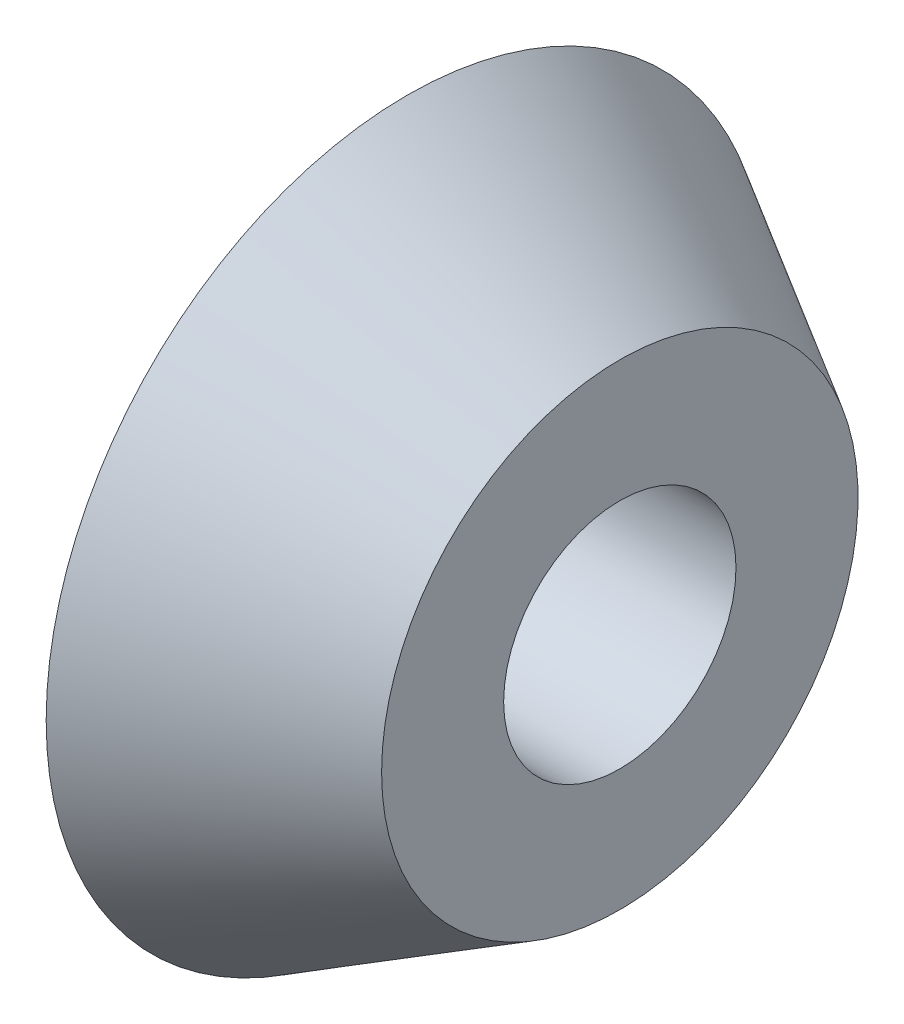
ISO-10303-21;
HEADER;
FILE_DESCRIPTION(('STEP AP214'),'2;1');
FILE_NAME('part.step','',(''),(''),'','','');
FILE_SCHEMA(('AUTOMOTIVE_DESIGN { 1 0 10303 214 1 1 1 1 }'));
ENDSEC;
DATA;
#1=APPLICATION_CONTEXT('core data for automotive mechanical design processes');
#2=APPLICATION_PROTOCOL_DEFINITION('international standard','automotive_design',2000,#1);
#3=PRODUCT_CONTEXT('',#1,'mechanical');
#4=PRODUCT('Part','Part','',(#3));
#5=PRODUCT_RELATED_PRODUCT_CATEGORY('part','',(#4));
#6=PRODUCT_DEFINITION_FORMATION('','',#4);
#7=PRODUCT_DEFINITION_CONTEXT('part definition',#1,'design');
#8=PRODUCT_DEFINITION('design','',#6,#7);
#9=PRODUCT_DEFINITION_SHAPE('','',#8);
#10=(LENGTH_UNIT() NAMED_UNIT(*) SI_UNIT(.MILLI.,.METRE.));
#11=(NAMED_UNIT(*) PLANE_ANGLE_UNIT() SI_UNIT($,.RADIAN.));
#12=(NAMED_UNIT(*) SI_UNIT($,.STERADIAN.) SOLID_ANGLE_UNIT());
#13=UNCERTAINTY_MEASURE_WITH_UNIT(LENGTH_MEASURE(1.E-05),#10,'distance_accuracy_value','');
#14=(GEOMETRIC_REPRESENTATION_CONTEXT(3) GLOBAL_UNCERTAINTY_ASSIGNED_CONTEXT((#13)) GLOBAL_UNIT_ASSIGNED_CONTEXT((#10,
#11,#12)) REPRESENTATION_CONTEXT('',''));
#15=CARTESIAN_POINT('',(0.,0.,0.));
#16=DIRECTION('',(0.,0.,1.));
#17=DIRECTION('',(1.,0.,0.));
#18=AXIS2_PLACEMENT_3D('',#15,#16,#17);
#19=CARTESIAN_POINT('',(4.41320981879205,15.494,0.));
#20=DIRECTION('',(1.,0.,0.));
#21=DIRECTION('',(0.,0.,-1.));
#22=AXIS2_PLACEMENT_3D('',#19,#20,#21);
#23=PLANE('',#22);
#24=CARTESIAN_POINT('',(4.41320981879205,0.,0.));
#25=DIRECTION('',(-1.,0.,0.));
#26=DIRECTION('',(0.,0.,1.));
#27=AXIS2_PLACEMENT_3D('',#24,#25,#26);
#28=CIRCLE('',#27,8.0518);
#29=CARTESIAN_POINT('',(4.41320981879205,0.,8.0518));
#30=VERTEX_POINT('',#29);
#31=EDGE_CURVE('E10',#30,#30,#28,.T.);
#32=ORIENTED_EDGE('',*,*,#31,.F.);
#33=EDGE_LOOP('',(#32));
#34=FACE_BOUND('',#33,.T.);
#35=CARTESIAN_POINT('',(4.41320981879205,0.,0.));
#36=DIRECTION('',(-1.,0.,0.));
#37=DIRECTION('',(0.,0.,1.));
#38=AXIS2_PLACEMENT_3D('',#35,#36,#37);
#39=CIRCLE('',#38,15.494);
#40=CARTESIAN_POINT('',(4.41320981879205,0.,15.494));
#41=VERTEX_POINT('',#40);
#42=EDGE_CURVE('E58',#41,#41,#39,.T.);
#43=ORIENTED_EDGE('',*,*,#42,.T.);
#44=EDGE_LOOP('',(#43));
#45=FACE_BOUND('',#44,.T.);
#46=ADVANCED_FACE('F33',(#34,#45),#23,.F.);
#47=CARTESIAN_POINT('',(0.,0.,0.));
#48=DIRECTION('',(-1.,0.,0.));
#49=DIRECTION('',(0.,0.,1.));
#50=AXIS2_PLACEMENT_3D('',#47,#48,#49);
#51=CYLINDRICAL_SURFACE('',#50,8.0518);
#52=CARTESIAN_POINT('',(25.5012301403958,0.,0.));
#53=DIRECTION('',(-1.,0.,0.));
#54=DIRECTION('',(0.,0.,1.));
#55=AXIS2_PLACEMENT_3D('',#52,#53,#54);
#56=CIRCLE('',#55,8.0518);
#57=CARTESIAN_POINT('',(25.5012301403958,0.,8.0518));
#58=VERTEX_POINT('',#57);
#59=EDGE_CURVE('E39',#58,#58,#56,.T.);
#60=ORIENTED_EDGE('',*,*,#59,.F.);
#61=EDGE_LOOP('',(#60));
#62=FACE_BOUND('',#61,.T.);
#63=ORIENTED_EDGE('',*,*,#31,.T.);
#64=EDGE_LOOP('',(#63));
#65=FACE_BOUND('',#64,.T.);
#66=ADVANCED_FACE('F89',(#62,#65),#51,.F.);
#67=CARTESIAN_POINT('',(25.5012301403958,8.0518,0.));
#68=DIRECTION('',(-1.,0.,0.));
#69=DIRECTION('',(0.,0.,1.));
#70=AXIS2_PLACEMENT_3D('',#67,#68,#69);
#71=PLANE('',#70);
#72=CARTESIAN_POINT('',(25.5012301403958,0.,0.));
#73=DIRECTION('',(-1.,0.,0.));
#74=DIRECTION('',(0.,0.,1.));
#75=AXIS2_PLACEMENT_3D('',#72,#73,#74);
#76=CIRCLE('',#75,16.51);
#77=CARTESIAN_POINT('',(25.5012301403958,0.,16.51));
#78=VERTEX_POINT('',#77);
#79=EDGE_CURVE('E43',#78,#78,#76,.T.);
#80=ORIENTED_EDGE('',*,*,#79,.F.);
#81=EDGE_LOOP('',(#80));
#82=FACE_BOUND('',#81,.T.);
#83=ORIENTED_EDGE('',*,*,#59,.T.);
#84=EDGE_LOOP('',(#83));
#85=FACE_BOUND('',#84,.T.);
#86=ADVANCED_FACE('F84',(#82,#85),#71,.F.);
#87=CARTESIAN_POINT('',(25.5012301403958,0.,0.));
#88=DIRECTION('',(-1.,0.,0.));
#89=DIRECTION('',(0.,0.,1.));
#90=AXIS2_PLACEMENT_3D('',#87,#88,#89);
#91=CONICAL_SURFACE('',#90,16.51,0.523598775598293);
#92=CARTESIAN_POINT('',(10.763209818792,0.,0.));
#93=DIRECTION('',(-1.,0.,0.));
#94=DIRECTION('',(0.,0.,1.));
#95=AXIS2_PLACEMENT_3D('',#92,#93,#94);
#96=CIRCLE('',#95,25.019);
#97=CARTESIAN_POINT('',(10.763209818792,0.,25.019));
#98=VERTEX_POINT('',#97);
#99=EDGE_CURVE('E47',#98,#98,#96,.T.);
#100=ORIENTED_EDGE('',*,*,#99,.F.);
#101=EDGE_LOOP('',(#100));
#102=FACE_BOUND('',#101,.T.);
#103=ORIENTED_EDGE('',*,*,#79,.T.);
#104=EDGE_LOOP('',(#103));
#105=FACE_BOUND('',#104,.T.);
#106=ADVANCED_FACE('F78',(#102,#105),#91,.T.);
#107=CARTESIAN_POINT('',(10.763209818792,25.019,0.));
#108=DIRECTION('',(1.,0.,0.));
#109=DIRECTION('',(0.,0.,-1.));
#110=AXIS2_PLACEMENT_3D('',#107,#108,#109);
#111=PLANE('',#110);
#112=CARTESIAN_POINT('',(10.763209818792,0.,0.));
#113=DIRECTION('',(-1.,0.,0.));
#114=DIRECTION('',(0.,0.,1.));
#115=AXIS2_PLACEMENT_3D('',#112,#113,#114);
#116=CIRCLE('',#115,16.51);
#117=CARTESIAN_POINT('',(10.763209818792,0.,16.51));
#118=VERTEX_POINT('',#117);
#119=EDGE_CURVE('E52',#118,#118,#116,.T.);
#120=ORIENTED_EDGE('',*,*,#119,.F.);
#121=EDGE_LOOP('',(#120));
#122=FACE_BOUND('',#121,.T.);
#123=ORIENTED_EDGE('',*,*,#99,.T.);
#124=EDGE_LOOP('',(#123));
#125=FACE_BOUND('',#124,.T.);
#126=ADVANCED_FACE('F72',(#122,#125),#111,.F.);
#127=CARTESIAN_POINT('',(10.763209818792,0.,0.));
#128=DIRECTION('',(1.,0.,0.));
#129=DIRECTION('',(0.,0.,-1.));
#130=AXIS2_PLACEMENT_3D('',#127,#128,#129);
#131=CONICAL_SURFACE('',#130,16.51,0.785398163397448);
#132=CARTESIAN_POINT('',(9.74720981879205,0.,0.));
#133=DIRECTION('',(-1.,0.,0.));
#134=DIRECTION('',(0.,0.,1.));
#135=AXIS2_PLACEMENT_3D('',#132,#133,#134);
#136=CIRCLE('',#135,15.494);
#137=CARTESIAN_POINT('',(9.74720981879205,0.,15.494));
#138=VERTEX_POINT('',#137);
#139=EDGE_CURVE('E55',#138,#138,#136,.T.);
#140=ORIENTED_EDGE('',*,*,#139,.F.);
#141=EDGE_LOOP('',(#140));
#142=FACE_BOUND('',#141,.T.);
#143=ORIENTED_EDGE('',*,*,#119,.T.);
#144=EDGE_LOOP('',(#143));
#145=FACE_BOUND('',#144,.T.);
#146=ADVANCED_FACE('F66',(#142,#145),#131,.T.);
#147=CARTESIAN_POINT('',(0.,0.,0.));
#148=DIRECTION('',(-1.,0.,0.));
#149=DIRECTION('',(0.,0.,1.));
#150=AXIS2_PLACEMENT_3D('',#147,#148,#149);
#151=CYLINDRICAL_SURFACE('',#150,15.494);
#152=ORIENTED_EDGE('',*,*,#42,.F.);
#153=EDGE_LOOP('',(#152));
#154=FACE_BOUND('',#153,.T.);
#155=ORIENTED_EDGE('',*,*,#139,.T.);
#156=EDGE_LOOP('',(#155));
#157=FACE_BOUND('',#156,.T.);
#158=ADVANCED_FACE('F63',(#154,#157),#151,.T.);
#159=CLOSED_SHELL('',(#46,#66,#86,#106,#126,#146,#158));
#160=MANIFOLD_SOLID_BREP('B2',#159);
#161=ADVANCED_BREP_SHAPE_REPRESENTATION('',(#18,#160),#14);
#162=SHAPE_DEFINITION_REPRESENTATION(#9,#161);
ENDSEC;
END-ISO-10303-21;
